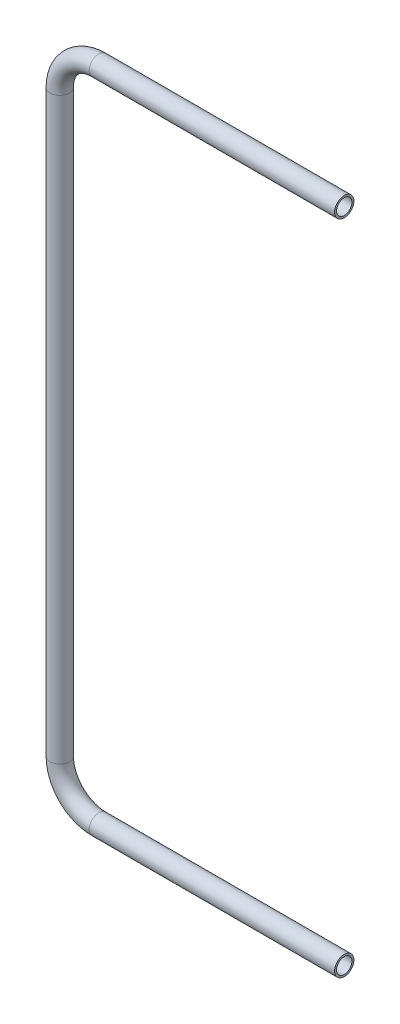
ISO-10303-21;
HEADER;
FILE_DESCRIPTION(('STEP AP214'),'2;1');
FILE_NAME('part.step','',(''),(''),'','','');
FILE_SCHEMA(('AUTOMOTIVE_DESIGN { 1 0 10303 214 1 1 1 1 }'));
ENDSEC;
DATA;
#1=APPLICATION_CONTEXT('core data for automotive mechanical design processes');
#2=APPLICATION_PROTOCOL_DEFINITION('international standard','automotive_design',2000,#1);
#3=PRODUCT_CONTEXT('',#1,'mechanical');
#4=PRODUCT('Part','Part','',(#3));
#5=PRODUCT_RELATED_PRODUCT_CATEGORY('part','',(#4));
#6=PRODUCT_DEFINITION_FORMATION('','',#4);
#7=PRODUCT_DEFINITION_CONTEXT('part definition',#1,'design');
#8=PRODUCT_DEFINITION('design','',#6,#7);
#9=PRODUCT_DEFINITION_SHAPE('','',#8);
#10=(LENGTH_UNIT() NAMED_UNIT(*) SI_UNIT(.MILLI.,.METRE.));
#11=(NAMED_UNIT(*) PLANE_ANGLE_UNIT() SI_UNIT($,.RADIAN.));
#12=(NAMED_UNIT(*) SI_UNIT($,.STERADIAN.) SOLID_ANGLE_UNIT());
#13=UNCERTAINTY_MEASURE_WITH_UNIT(LENGTH_MEASURE(1.E-05),#10,'distance_accuracy_value','');
#14=(GEOMETRIC_REPRESENTATION_CONTEXT(3) GLOBAL_UNCERTAINTY_ASSIGNED_CONTEXT((#13)) GLOBAL_UNIT_ASSIGNED_CONTEXT((#10,
#11,#12)) REPRESENTATION_CONTEXT('',''));
#15=CARTESIAN_POINT('',(0.,0.,0.));
#16=DIRECTION('',(0.,0.,1.));
#17=DIRECTION('',(1.,0.,0.));
#18=AXIS2_PLACEMENT_3D('',#15,#16,#17);
#19=CARTESIAN_POINT('',(0.,0.,0.));
#20=DIRECTION('',(-1.,0.,0.));
#21=DIRECTION('',(0.,-1.,0.));
#22=AXIS2_PLACEMENT_3D('',#19,#20,#21);
#23=CYLINDRICAL_SURFACE('',#22,16.7005);
#24=CARTESIAN_POINT('',(-423.799,0.,0.));
#25=DIRECTION('',(-1.,0.,0.));
#26=DIRECTION('',(0.,0.,1.));
#27=AXIS2_PLACEMENT_3D('',#24,#25,#26);
#28=CIRCLE('',#27,16.7005);
#29=CARTESIAN_POINT('',(-423.799,-16.7005000000001,0.));
#30=VERTEX_POINT('',#29);
#31=EDGE_CURVE('E82',#30,#30,#28,.T.);
#32=ORIENTED_EDGE('',*,*,#31,.F.);
#33=EDGE_LOOP('',(#32));
#34=FACE_BOUND('',#33,.T.);
#35=CARTESIAN_POINT('',(0.,0.,0.));
#36=DIRECTION('',(-1.,0.,0.));
#37=DIRECTION('',(0.,0.,1.));
#38=AXIS2_PLACEMENT_3D('',#35,#36,#37);
#39=CIRCLE('',#38,16.7005);
#40=CARTESIAN_POINT('',(0.,0.,16.7005));
#41=VERTEX_POINT('',#40);
#42=EDGE_CURVE('E50',#41,#41,#39,.T.);
#43=ORIENTED_EDGE('',*,*,#42,.T.);
#44=EDGE_LOOP('',(#43));
#45=FACE_BOUND('',#44,.T.);
#46=ADVANCED_FACE('F35',(#34,#45),#23,.T.);
#47=CARTESIAN_POINT('',(-423.799,67.5005,0.));
#48=DIRECTION('',(0.,0.,1.));
#49=DIRECTION('',(-1.,0.,0.));
#50=AXIS2_PLACEMENT_3D('',#47,#48,#49);
#51=TOROIDAL_SURFACE('',#50,67.5005,16.7005);
#52=CARTESIAN_POINT('',(-491.2995,67.5005,0.));
#53=DIRECTION('',(0.,1.,0.));
#54=DIRECTION('',(0.,0.,1.));
#55=AXIS2_PLACEMENT_3D('',#52,#53,#54);
#56=CIRCLE('',#55,16.7005);
#57=CARTESIAN_POINT('',(-508.,67.5005,0.));
#58=VERTEX_POINT('',#57);
#59=EDGE_CURVE('E85',#58,#58,#56,.T.);
#60=CARTESIAN_POINT('',(-423.799,67.5005,0.));
#61=DIRECTION('',(0.,0.,1.));
#62=DIRECTION('',(-1.,0.,0.));
#63=AXIS2_PLACEMENT_3D('',#60,#61,#62);
#64=CIRCLE('',#63,84.201);
#65=EDGE_CURVE('',#58,#30,#64,.T.);
#66=ORIENTED_EDGE('',*,*,#59,.F.);
#67=ORIENTED_EDGE('',*,*,#31,.T.);
#68=ORIENTED_EDGE('',*,*,#65,.T.);
#69=ORIENTED_EDGE('',*,*,#65,.F.);
#70=EDGE_LOOP('',(#66,#68,#67,#69));
#71=FACE_BOUND('',#70,.T.);
#72=ADVANCED_FACE('F104',(#71),#51,.T.);
#73=CARTESIAN_POINT('',(-491.2995,67.5005,0.));
#74=DIRECTION('',(0.,1.,0.));
#75=DIRECTION('',(-1.,0.,0.));
#76=AXIS2_PLACEMENT_3D('',#73,#74,#75);
#77=CYLINDRICAL_SURFACE('',#76,16.7005);
#78=CARTESIAN_POINT('',(-491.2995,1067.562,0.));
#79=DIRECTION('',(0.,1.,0.));
#80=DIRECTION('',(0.,0.,1.));
#81=AXIS2_PLACEMENT_3D('',#78,#79,#80);
#82=CIRCLE('',#81,16.7005);
#83=CARTESIAN_POINT('',(-508.,1067.562,0.));
#84=VERTEX_POINT('',#83);
#85=EDGE_CURVE('E87',#84,#84,#82,.T.);
#86=ORIENTED_EDGE('',*,*,#85,.F.);
#87=EDGE_LOOP('',(#86));
#88=FACE_BOUND('',#87,.T.);
#89=ORIENTED_EDGE('',*,*,#59,.T.);
#90=EDGE_LOOP('',(#89));
#91=FACE_BOUND('',#90,.T.);
#92=ADVANCED_FACE('F97',(#88,#91),#77,.T.);
#93=CARTESIAN_POINT('',(-423.799,1067.562,0.));
#94=DIRECTION('',(0.,0.,1.));
#95=DIRECTION('',(-1.,0.,0.));
#96=AXIS2_PLACEMENT_3D('',#93,#94,#95);
#97=TOROIDAL_SURFACE('',#96,67.5005,16.7005);
#98=CARTESIAN_POINT('',(-423.799,1135.0625,0.));
#99=DIRECTION('',(1.,0.,0.));
#100=DIRECTION('',(0.,0.,1.));
#101=AXIS2_PLACEMENT_3D('',#98,#99,#100);
#102=CIRCLE('',#101,16.7005);
#103=CARTESIAN_POINT('',(-423.799,1151.763,0.));
#104=VERTEX_POINT('',#103);
#105=EDGE_CURVE('E39',#104,#104,#102,.T.);
#106=CARTESIAN_POINT('',(-423.799,1067.562,0.));
#107=DIRECTION('',(0.,0.,1.));
#108=DIRECTION('',(-1.,0.,0.));
#109=AXIS2_PLACEMENT_3D('',#106,#107,#108);
#110=CIRCLE('',#109,84.201);
#111=EDGE_CURVE('',#104,#84,#110,.T.);
#112=ORIENTED_EDGE('',*,*,#105,.F.);
#113=ORIENTED_EDGE('',*,*,#85,.T.);
#114=ORIENTED_EDGE('',*,*,#111,.T.);
#115=ORIENTED_EDGE('',*,*,#111,.F.);
#116=EDGE_LOOP('',(#112,#114,#113,#115));
#117=FACE_BOUND('',#116,.T.);
#118=ADVANCED_FACE('F95',(#117),#97,.T.);
#119=CARTESIAN_POINT('',(-423.799,1135.0625,0.));
#120=DIRECTION('',(1.,0.,0.));
#121=DIRECTION('',(0.,0.,1.));
#122=AXIS2_PLACEMENT_3D('',#119,#120,#121);
#123=CYLINDRICAL_SURFACE('',#122,16.7005);
#124=CARTESIAN_POINT('',(-3.33066907387547E-13,1135.0625,0.));
#125=DIRECTION('',(1.,0.,0.));
#126=DIRECTION('',(0.,0.,1.));
#127=AXIS2_PLACEMENT_3D('',#124,#125,#126);
#128=CIRCLE('',#127,16.7005);
#129=CARTESIAN_POINT('',(-3.33066907387547E-13,1135.0625,16.7005));
#130=VERTEX_POINT('',#129);
#131=EDGE_CURVE('E55',#130,#130,#128,.T.);
#132=ORIENTED_EDGE('',*,*,#131,.F.);
#133=EDGE_LOOP('',(#132));
#134=FACE_BOUND('',#133,.T.);
#135=ORIENTED_EDGE('',*,*,#105,.T.);
#136=EDGE_LOOP('',(#135));
#137=FACE_BOUND('',#136,.T.);
#138=ADVANCED_FACE('F37',(#134,#137),#123,.T.);
#139=CARTESIAN_POINT('',(0.,0.,0.));
#140=DIRECTION('',(1.,0.,0.));
#141=DIRECTION('',(0.,0.,1.));
#142=AXIS2_PLACEMENT_3D('',#139,#140,#141);
#143=PLANE('',#142);
#144=CARTESIAN_POINT('',(0.,0.,0.));
#145=DIRECTION('',(-1.,0.,0.));
#146=DIRECTION('',(0.,0.,1.));
#147=AXIS2_PLACEMENT_3D('',#144,#145,#146);
#148=CIRCLE('',#147,13.335);
#149=CARTESIAN_POINT('',(0.,0.,13.335));
#150=VERTEX_POINT('',#149);
#151=EDGE_CURVE('E80',#150,#150,#148,.F.);
#152=ORIENTED_EDGE('',*,*,#151,.F.);
#153=EDGE_LOOP('',(#152));
#154=FACE_BOUND('',#153,.T.);
#155=ORIENTED_EDGE('',*,*,#42,.F.);
#156=EDGE_LOOP('',(#155));
#157=FACE_BOUND('',#156,.T.);
#158=ADVANCED_FACE('F102',(#154,#157),#143,.T.);
#159=CARTESIAN_POINT('',(-3.33066907387547E-13,1135.0625,0.));
#160=DIRECTION('',(-1.,0.,0.));
#161=DIRECTION('',(0.,0.,1.));
#162=AXIS2_PLACEMENT_3D('',#159,#160,#161);
#163=PLANE('',#162);
#164=CARTESIAN_POINT('',(-3.33066907387547E-13,1135.0625,0.));
#165=DIRECTION('',(1.,0.,0.));
#166=DIRECTION('',(0.,0.,1.));
#167=AXIS2_PLACEMENT_3D('',#164,#165,#166);
#168=CIRCLE('',#167,13.335);
#169=CARTESIAN_POINT('',(-3.33066907387547E-13,1135.0625,13.335));
#170=VERTEX_POINT('',#169);
#171=EDGE_CURVE('E11',#170,#170,#168,.F.);
#172=ORIENTED_EDGE('',*,*,#171,.T.);
#173=EDGE_LOOP('',(#172));
#174=FACE_BOUND('',#173,.T.);
#175=ORIENTED_EDGE('',*,*,#131,.T.);
#176=EDGE_LOOP('',(#175));
#177=FACE_BOUND('',#176,.T.);
#178=ADVANCED_FACE('F62',(#174,#177),#163,.F.);
#179=CARTESIAN_POINT('',(0.,0.,0.));
#180=DIRECTION('',(-1.,0.,0.));
#181=DIRECTION('',(0.,-1.,0.));
#182=AXIS2_PLACEMENT_3D('',#179,#180,#181);
#183=CYLINDRICAL_SURFACE('',#182,13.335);
#184=CARTESIAN_POINT('',(-423.799,0.,0.));
#185=DIRECTION('',(-1.,0.,0.));
#186=DIRECTION('',(0.,0.,1.));
#187=AXIS2_PLACEMENT_3D('',#184,#185,#186);
#188=CIRCLE('',#187,13.335);
#189=CARTESIAN_POINT('',(-423.799,-13.3350000000001,0.));
#190=VERTEX_POINT('',#189);
#191=EDGE_CURVE('E140',#190,#190,#188,.F.);
#192=ORIENTED_EDGE('',*,*,#191,.F.);
#193=EDGE_LOOP('',(#192));
#194=FACE_BOUND('',#193,.T.);
#195=ORIENTED_EDGE('',*,*,#151,.T.);
#196=EDGE_LOOP('',(#195));
#197=FACE_BOUND('',#196,.T.);
#198=ADVANCED_FACE('F121',(#194,#197),#183,.F.);
#199=CARTESIAN_POINT('',(-423.799,67.5005,0.));
#200=DIRECTION('',(0.,0.,1.));
#201=DIRECTION('',(-1.,0.,0.));
#202=AXIS2_PLACEMENT_3D('',#199,#200,#201);
#203=TOROIDAL_SURFACE('',#202,67.5005,13.335);
#204=CARTESIAN_POINT('',(-491.2995,67.5005,0.));
#205=DIRECTION('',(0.,1.,0.));
#206=DIRECTION('',(0.,0.,1.));
#207=AXIS2_PLACEMENT_3D('',#204,#205,#206);
#208=CIRCLE('',#207,13.335);
#209=CARTESIAN_POINT('',(-504.6345,67.5005,0.));
#210=VERTEX_POINT('',#209);
#211=EDGE_CURVE('E75',#210,#210,#208,.F.);
#212=CARTESIAN_POINT('',(-423.799,67.5005,0.));
#213=DIRECTION('',(0.,0.,1.));
#214=DIRECTION('',(-1.,0.,0.));
#215=AXIS2_PLACEMENT_3D('',#212,#213,#214);
#216=CIRCLE('',#215,80.8355);
#217=EDGE_CURVE('',#210,#190,#216,.T.);
#218=ORIENTED_EDGE('',*,*,#211,.F.);
#219=ORIENTED_EDGE('',*,*,#191,.T.);
#220=ORIENTED_EDGE('',*,*,#217,.T.);
#221=ORIENTED_EDGE('',*,*,#217,.F.);
#222=EDGE_LOOP('',(#218,#220,#219,#221));
#223=FACE_BOUND('',#222,.T.);
#224=ADVANCED_FACE('F128',(#223),#203,.F.);
#225=CARTESIAN_POINT('',(-491.2995,67.5005,0.));
#226=DIRECTION('',(0.,1.,0.));
#227=DIRECTION('',(-1.,0.,0.));
#228=AXIS2_PLACEMENT_3D('',#225,#226,#227);
#229=CYLINDRICAL_SURFACE('',#228,13.335);
#230=CARTESIAN_POINT('',(-491.2995,1067.562,0.));
#231=DIRECTION('',(0.,1.,0.));
#232=DIRECTION('',(0.,0.,1.));
#233=AXIS2_PLACEMENT_3D('',#230,#231,#232);
#234=CIRCLE('',#233,13.335);
#235=CARTESIAN_POINT('',(-504.6345,1067.562,0.));
#236=VERTEX_POINT('',#235);
#237=EDGE_CURVE('E72',#236,#236,#234,.F.);
#238=ORIENTED_EDGE('',*,*,#237,.F.);
#239=EDGE_LOOP('',(#238));
#240=FACE_BOUND('',#239,.T.);
#241=ORIENTED_EDGE('',*,*,#211,.T.);
#242=EDGE_LOOP('',(#241));
#243=FACE_BOUND('',#242,.T.);
#244=ADVANCED_FACE('F125',(#240,#243),#229,.F.);
#245=CARTESIAN_POINT('',(-423.799,1067.562,0.));
#246=DIRECTION('',(0.,0.,1.));
#247=DIRECTION('',(-1.,0.,0.));
#248=AXIS2_PLACEMENT_3D('',#245,#246,#247);
#249=TOROIDAL_SURFACE('',#248,67.5005,13.335);
#250=CARTESIAN_POINT('',(-423.799,1135.0625,0.));
#251=DIRECTION('',(1.,0.,0.));
#252=DIRECTION('',(0.,0.,1.));
#253=AXIS2_PLACEMENT_3D('',#250,#251,#252);
#254=CIRCLE('',#253,13.335);
#255=CARTESIAN_POINT('',(-423.799,1148.3975,0.));
#256=VERTEX_POINT('',#255);
#257=EDGE_CURVE('E44',#256,#256,#254,.F.);
#258=CARTESIAN_POINT('',(-423.799,1067.562,0.));
#259=DIRECTION('',(0.,0.,1.));
#260=DIRECTION('',(-1.,0.,0.));
#261=AXIS2_PLACEMENT_3D('',#258,#259,#260);
#262=CIRCLE('',#261,80.8355);
#263=EDGE_CURVE('',#256,#236,#262,.T.);
#264=ORIENTED_EDGE('',*,*,#257,.F.);
#265=ORIENTED_EDGE('',*,*,#237,.T.);
#266=ORIENTED_EDGE('',*,*,#263,.T.);
#267=ORIENTED_EDGE('',*,*,#263,.F.);
#268=EDGE_LOOP('',(#264,#266,#265,#267));
#269=FACE_BOUND('',#268,.T.);
#270=ADVANCED_FACE('F67',(#269),#249,.F.);
#271=CARTESIAN_POINT('',(-423.799,1135.0625,0.));
#272=DIRECTION('',(1.,0.,0.));
#273=DIRECTION('',(0.,0.,1.));
#274=AXIS2_PLACEMENT_3D('',#271,#272,#273);
#275=CYLINDRICAL_SURFACE('',#274,13.335);
#276=ORIENTED_EDGE('',*,*,#171,.F.);
#277=EDGE_LOOP('',(#276));
#278=FACE_BOUND('',#277,.T.);
#279=ORIENTED_EDGE('',*,*,#257,.T.);
#280=EDGE_LOOP('',(#279));
#281=FACE_BOUND('',#280,.T.);
#282=ADVANCED_FACE('F64',(#278,#281),#275,.F.);
#283=CLOSED_SHELL('',(#46,#72,#92,#118,#138,#158,#178,#198,#224,#244,#270,#282));
#284=MANIFOLD_SOLID_BREP('B2',#283);
#285=ADVANCED_BREP_SHAPE_REPRESENTATION('',(#18,#284),#14);
#286=SHAPE_DEFINITION_REPRESENTATION(#9,#285);
ENDSEC;
END-ISO-10303-21;
